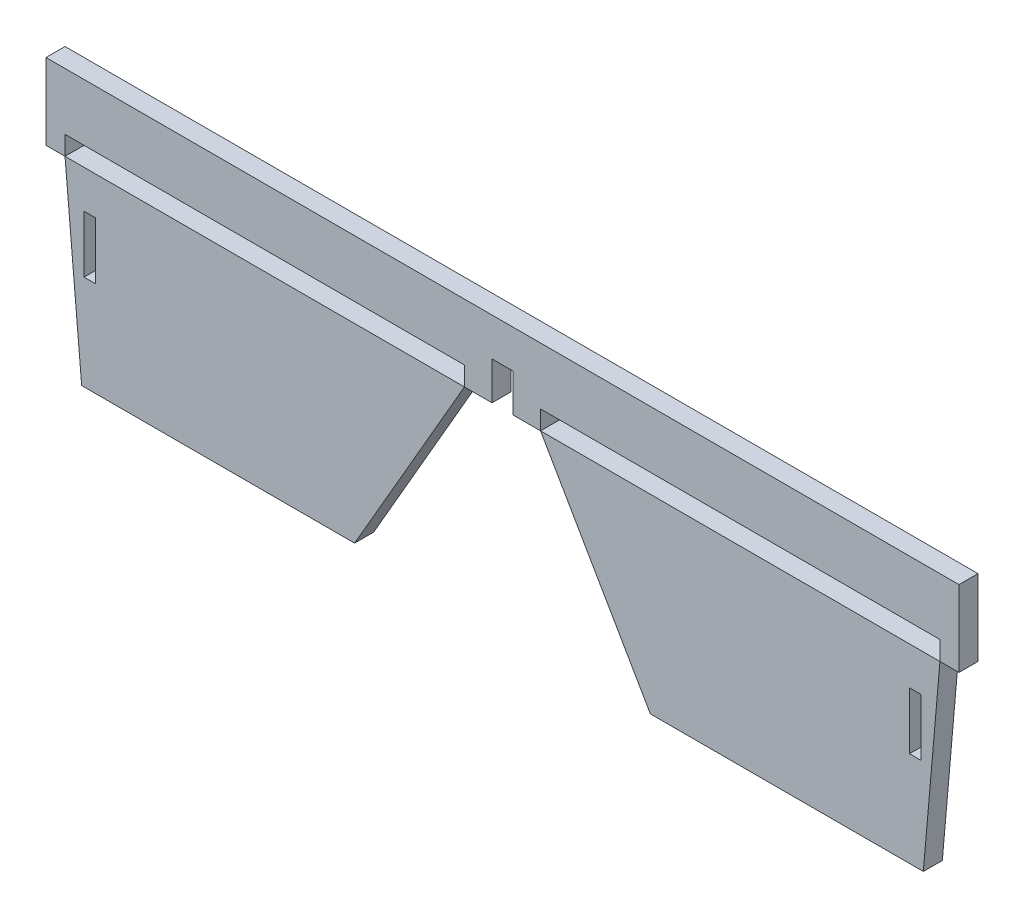
ISO-10303-21;
HEADER;
FILE_DESCRIPTION(('STEP AP214'),'2;1');
FILE_NAME('part.step','',(''),(''),'','','');
FILE_SCHEMA(('AUTOMOTIVE_DESIGN { 1 0 10303 214 1 1 1 1 }'));
ENDSEC;
DATA;
#1=APPLICATION_CONTEXT('core data for automotive mechanical design processes');
#2=APPLICATION_PROTOCOL_DEFINITION('international standard','automotive_design',2000,#1);
#3=PRODUCT_CONTEXT('',#1,'mechanical');
#4=PRODUCT('Part','Part','',(#3));
#5=PRODUCT_RELATED_PRODUCT_CATEGORY('part','',(#4));
#6=PRODUCT_DEFINITION_FORMATION('','',#4);
#7=PRODUCT_DEFINITION_CONTEXT('part definition',#1,'design');
#8=PRODUCT_DEFINITION('design','',#6,#7);
#9=PRODUCT_DEFINITION_SHAPE('','',#8);
#10=(LENGTH_UNIT() NAMED_UNIT(*) SI_UNIT(.MILLI.,.METRE.));
#11=(NAMED_UNIT(*) PLANE_ANGLE_UNIT() SI_UNIT($,.RADIAN.));
#12=(NAMED_UNIT(*) SI_UNIT($,.STERADIAN.) SOLID_ANGLE_UNIT());
#13=UNCERTAINTY_MEASURE_WITH_UNIT(LENGTH_MEASURE(1.E-05),#10,'distance_accuracy_value','');
#14=(GEOMETRIC_REPRESENTATION_CONTEXT(3) GLOBAL_UNCERTAINTY_ASSIGNED_CONTEXT((#13)) GLOBAL_UNIT_ASSIGNED_CONTEXT((#10,
#11,#12)) REPRESENTATION_CONTEXT('',''));
#15=CARTESIAN_POINT('',(0.,0.,0.));
#16=DIRECTION('',(0.,0.,1.));
#17=DIRECTION('',(1.,0.,0.));
#18=AXIS2_PLACEMENT_3D('',#15,#16,#17);
#19=CARTESIAN_POINT('',(0.,-20.,2.5));
#20=DIRECTION('',(0.,1.,0.));
#21=DIRECTION('',(0.,0.,1.));
#22=AXIS2_PLACEMENT_3D('',#19,#20,#21);
#23=PLANE('',#22);
#24=DIRECTION('',(-1.,0.,0.));
#25=VECTOR('',#24,1.);
#26=CARTESIAN_POINT('',(0.,-20.,-2.5));
#27=LINE('',#26,#25);
#28=CARTESIAN_POINT('',(110.,-20.,-2.5));
#29=VERTEX_POINT('',#28);
#30=CARTESIAN_POINT('',(107.,-20.,-2.5));
#31=VERTEX_POINT('',#30);
#32=EDGE_CURVE('E154',#29,#31,#27,.T.);
#33=ORIENTED_EDGE('',*,*,#32,.F.);
#34=DIRECTION('',(0.,0.,-1.));
#35=VECTOR('',#34,1.);
#36=CARTESIAN_POINT('',(110.,-20.,2.5));
#37=LINE('',#36,#35);
#38=CARTESIAN_POINT('',(110.,-20.,2.5));
#39=VERTEX_POINT('',#38);
#40=EDGE_CURVE('E161',#39,#29,#37,.T.);
#41=ORIENTED_EDGE('',*,*,#40,.F.);
#42=DIRECTION('',(-1.,0.,0.));
#43=VECTOR('',#42,1.);
#44=CARTESIAN_POINT('',(0.,-20.,2.5));
#45=LINE('',#44,#43);
#46=CARTESIAN_POINT('',(107.,-20.,2.5));
#47=VERTEX_POINT('',#46);
#48=EDGE_CURVE('E136',#39,#47,#45,.T.);
#49=ORIENTED_EDGE('',*,*,#48,.T.);
#50=DIRECTION('',(0.,0.,-1.));
#51=VECTOR('',#50,1.);
#52=CARTESIAN_POINT('',(107.,-20.,2.5));
#53=LINE('',#52,#51);
#54=EDGE_CURVE('E12',#47,#31,#53,.T.);
#55=ORIENTED_EDGE('',*,*,#54,.T.);
#56=EDGE_LOOP('',(#33,#41,#49,#55));
#57=FACE_BOUND('',#56,.T.);
#58=ADVANCED_FACE('F46',(#57),#23,.F.);
#59=CARTESIAN_POINT('',(107.,0.,2.5));
#60=DIRECTION('',(-1.,0.,0.));
#61=DIRECTION('',(0.,1.,0.));
#62=AXIS2_PLACEMENT_3D('',#59,#60,#61);
#63=PLANE('',#62);
#64=DIRECTION('',(0.,-1.,0.));
#65=VECTOR('',#64,1.);
#66=CARTESIAN_POINT('',(107.,0.,-2.5));
#67=LINE('',#66,#65);
#68=CARTESIAN_POINT('',(107.,-35.,-2.5));
#69=VERTEX_POINT('',#68);
#70=EDGE_CURVE('E156',#31,#69,#67,.T.);
#71=ORIENTED_EDGE('',*,*,#70,.F.);
#72=ORIENTED_EDGE('',*,*,#54,.F.);
#73=DIRECTION('',(0.,-1.,0.));
#74=VECTOR('',#73,1.);
#75=CARTESIAN_POINT('',(107.,0.,2.5));
#76=LINE('',#75,#74);
#77=CARTESIAN_POINT('',(107.,-35.,2.5));
#78=VERTEX_POINT('',#77);
#79=EDGE_CURVE('E123',#47,#78,#76,.T.);
#80=ORIENTED_EDGE('',*,*,#79,.T.);
#81=DIRECTION('',(0.,0.,-1.));
#82=VECTOR('',#81,1.);
#83=CARTESIAN_POINT('',(107.,-35.,2.5));
#84=LINE('',#83,#82);
#85=EDGE_CURVE('E56',#78,#69,#84,.T.);
#86=ORIENTED_EDGE('',*,*,#85,.T.);
#87=EDGE_LOOP('',(#71,#72,#80,#86));
#88=FACE_BOUND('',#87,.T.);
#89=ADVANCED_FACE('F134',(#88),#63,.F.);
#90=CARTESIAN_POINT('',(0.,-35.,2.5));
#91=DIRECTION('',(0.,1.,0.));
#92=DIRECTION('',(0.,0.,1.));
#93=AXIS2_PLACEMENT_3D('',#90,#91,#92);
#94=PLANE('',#93);
#95=DIRECTION('',(-1.,0.,0.));
#96=VECTOR('',#95,1.);
#97=CARTESIAN_POINT('',(0.,-35.,-2.5));
#98=LINE('',#97,#96);
#99=CARTESIAN_POINT('',(110.,-35.,-2.5));
#100=VERTEX_POINT('',#99);
#101=EDGE_CURVE('E129',#100,#69,#98,.T.);
#102=ORIENTED_EDGE('',*,*,#101,.T.);
#103=ORIENTED_EDGE('',*,*,#85,.F.);
#104=DIRECTION('',(-1.,0.,0.));
#105=VECTOR('',#104,1.);
#106=CARTESIAN_POINT('',(0.,-35.,2.5));
#107=LINE('',#106,#105);
#108=CARTESIAN_POINT('',(110.,-35.,2.5));
#109=VERTEX_POINT('',#108);
#110=EDGE_CURVE('E119',#109,#78,#107,.T.);
#111=ORIENTED_EDGE('',*,*,#110,.F.);
#112=DIRECTION('',(0.,0.,-1.));
#113=VECTOR('',#112,1.);
#114=CARTESIAN_POINT('',(110.,-35.,2.5));
#115=LINE('',#114,#113);
#116=EDGE_CURVE('E132',#109,#100,#115,.T.);
#117=ORIENTED_EDGE('',*,*,#116,.T.);
#118=EDGE_LOOP('',(#102,#103,#111,#117));
#119=FACE_BOUND('',#118,.T.);
#120=ADVANCED_FACE('F128',(#119),#94,.T.);
#121=CARTESIAN_POINT('',(114.994686686537,-10.0607314507871,2.5));
#122=DIRECTION('',(-0.996194698091746,0.0871557427476551,0.));
#123=DIRECTION('',(0.0871557427476551,0.996194698091746,0.));
#124=AXIS2_PLACEMENT_3D('',#121,#122,#123);
#125=PLANE('',#124);
#126=DIRECTION('',(-0.0871557427476551,-0.996194698091746,0.));
#127=VECTOR('',#126,1.);
#128=CARTESIAN_POINT('',(114.994686686537,-10.0607314507871,-2.5));
#129=LINE('',#128,#127);
#130=CARTESIAN_POINT('',(115.,-10.,-2.5));
#131=VERTEX_POINT('',#130);
#132=CARTESIAN_POINT('',(110.625566823704,-60.,-2.5));
#133=VERTEX_POINT('',#132);
#134=EDGE_CURVE('E144',#131,#133,#129,.T.);
#135=ORIENTED_EDGE('',*,*,#134,.F.);
#136=DIRECTION('',(0.,0.,-1.));
#137=VECTOR('',#136,1.);
#138=CARTESIAN_POINT('',(115.,-10.,2.5));
#139=LINE('',#138,#137);
#140=CARTESIAN_POINT('',(115.,-10.,2.5));
#141=VERTEX_POINT('',#140);
#142=EDGE_CURVE('E143',#141,#131,#139,.T.);
#143=ORIENTED_EDGE('',*,*,#142,.F.);
#144=DIRECTION('',(-0.0871557427476551,-0.996194698091746,0.));
#145=VECTOR('',#144,1.);
#146=CARTESIAN_POINT('',(114.994686686537,-10.0607314507871,2.5));
#147=LINE('',#146,#145);
#148=CARTESIAN_POINT('',(110.625566823704,-60.,2.5));
#149=VERTEX_POINT('',#148);
#150=EDGE_CURVE('E160',#141,#149,#147,.T.);
#151=ORIENTED_EDGE('',*,*,#150,.T.);
#152=DIRECTION('',(0.,0.,-1.));
#153=VECTOR('',#152,1.);
#154=CARTESIAN_POINT('',(110.625566823704,-60.,2.5));
#155=LINE('',#154,#153);
#156=EDGE_CURVE('E50',#149,#133,#155,.T.);
#157=ORIENTED_EDGE('',*,*,#156,.T.);
#158=EDGE_LOOP('',(#135,#143,#151,#157));
#159=FACE_BOUND('',#158,.T.);
#160=ADVANCED_FACE('F48',(#159),#125,.F.);
#161=CARTESIAN_POINT('',(0.,-60.,2.5));
#162=DIRECTION('',(0.,1.,0.));
#163=DIRECTION('',(0.,0.,1.));
#164=AXIS2_PLACEMENT_3D('',#161,#162,#163);
#165=PLANE('',#164);
#166=DIRECTION('',(-1.,0.,0.));
#167=VECTOR('',#166,1.);
#168=CARTESIAN_POINT('',(0.,-60.,-2.5));
#169=LINE('',#168,#167);
#170=CARTESIAN_POINT('',(38.8675134594816,-60.,-2.5));
#171=VERTEX_POINT('',#170);
#172=EDGE_CURVE('E147',#133,#171,#169,.T.);
#173=ORIENTED_EDGE('',*,*,#172,.F.);
#174=ORIENTED_EDGE('',*,*,#156,.F.);
#175=DIRECTION('',(-1.,0.,0.));
#176=VECTOR('',#175,1.);
#177=CARTESIAN_POINT('',(0.,-60.,2.5));
#178=LINE('',#177,#176);
#179=CARTESIAN_POINT('',(38.8675134594816,-60.,2.5));
#180=VERTEX_POINT('',#179);
#181=EDGE_CURVE('E104',#149,#180,#178,.T.);
#182=ORIENTED_EDGE('',*,*,#181,.T.);
#183=DIRECTION('',(0.,0.,-1.));
#184=VECTOR('',#183,1.);
#185=CARTESIAN_POINT('',(38.8675134594816,-60.,2.5));
#186=LINE('',#185,#184);
#187=EDGE_CURVE('E168',#180,#171,#186,.T.);
#188=ORIENTED_EDGE('',*,*,#187,.T.);
#189=EDGE_LOOP('',(#173,#174,#182,#188));
#190=FACE_BOUND('',#189,.T.);
#191=ADVANCED_FACE('F190',(#190),#165,.F.);
#192=CARTESIAN_POINT('',(3.16987298107774,1.83012701892218,2.5));
#193=DIRECTION('',(-0.866025403784436,-0.500000000000004,0.));
#194=DIRECTION('',(-0.500000000000004,0.866025403784436,0.));
#195=AXIS2_PLACEMENT_3D('',#192,#193,#194);
#196=PLANE('',#195);
#197=DIRECTION('',(0.500000000000004,-0.866025403784436,0.));
#198=VECTOR('',#197,1.);
#199=CARTESIAN_POINT('',(3.16987298107774,1.83012701892218,-2.5));
#200=LINE('',#199,#198);
#201=CARTESIAN_POINT('',(10.,-10.,-2.5));
#202=VERTEX_POINT('',#201);
#203=EDGE_CURVE('E150',#202,#171,#200,.T.);
#204=ORIENTED_EDGE('',*,*,#203,.T.);
#205=ORIENTED_EDGE('',*,*,#187,.F.);
#206=DIRECTION('',(0.500000000000004,-0.866025403784436,0.));
#207=VECTOR('',#206,1.);
#208=CARTESIAN_POINT('',(3.16987298107774,1.83012701892218,2.5));
#209=LINE('',#208,#207);
#210=CARTESIAN_POINT('',(10.,-10.,2.5));
#211=VERTEX_POINT('',#210);
#212=EDGE_CURVE('E184',#211,#180,#209,.T.);
#213=ORIENTED_EDGE('',*,*,#212,.F.);
#214=DIRECTION('',(0.,0.,-1.));
#215=VECTOR('',#214,1.);
#216=CARTESIAN_POINT('',(10.,-10.,2.5));
#217=LINE('',#216,#215);
#218=EDGE_CURVE('E166',#211,#202,#217,.T.);
#219=ORIENTED_EDGE('',*,*,#218,.T.);
#220=EDGE_LOOP('',(#204,#205,#213,#219));
#221=FACE_BOUND('',#220,.T.);
#222=ADVANCED_FACE('F189',(#221),#196,.T.);
#223=CARTESIAN_POINT('',(0.,-10.,2.5));
#224=DIRECTION('',(0.,1.,0.));
#225=DIRECTION('',(0.,0.,1.));
#226=AXIS2_PLACEMENT_3D('',#223,#224,#225);
#227=PLANE('',#226);
#228=DIRECTION('',(-1.,0.,0.));
#229=VECTOR('',#228,1.);
#230=CARTESIAN_POINT('',(0.,-10.,-2.5));
#231=LINE('',#230,#229);
#232=EDGE_CURVE('E152',#131,#202,#231,.T.);
#233=ORIENTED_EDGE('',*,*,#232,.T.);
#234=ORIENTED_EDGE('',*,*,#218,.F.);
#235=DIRECTION('',(-1.,0.,0.));
#236=VECTOR('',#235,1.);
#237=CARTESIAN_POINT('',(0.,-10.,2.5));
#238=LINE('',#237,#236);
#239=EDGE_CURVE('E138',#141,#211,#238,.T.);
#240=ORIENTED_EDGE('',*,*,#239,.F.);
#241=ORIENTED_EDGE('',*,*,#142,.T.);
#242=EDGE_LOOP('',(#233,#234,#240,#241));
#243=FACE_BOUND('',#242,.T.);
#244=ADVANCED_FACE('F182',(#243),#227,.T.);
#245=CARTESIAN_POINT('',(110.,0.,2.5));
#246=DIRECTION('',(-1.,0.,0.));
#247=DIRECTION('',(0.,0.,-1.));
#248=AXIS2_PLACEMENT_3D('',#245,#246,#247);
#249=PLANE('',#248);
#250=DIRECTION('',(0.,-1.,0.));
#251=VECTOR('',#250,1.);
#252=CARTESIAN_POINT('',(110.,0.,-2.5));
#253=LINE('',#252,#251);
#254=EDGE_CURVE('E91',#29,#100,#253,.T.);
#255=ORIENTED_EDGE('',*,*,#254,.T.);
#256=ORIENTED_EDGE('',*,*,#116,.F.);
#257=DIRECTION('',(0.,-1.,0.));
#258=VECTOR('',#257,1.);
#259=CARTESIAN_POINT('',(110.,0.,2.5));
#260=LINE('',#259,#258);
#261=EDGE_CURVE('E65',#39,#109,#260,.T.);
#262=ORIENTED_EDGE('',*,*,#261,.F.);
#263=ORIENTED_EDGE('',*,*,#40,.T.);
#264=EDGE_LOOP('',(#255,#256,#262,#263));
#265=FACE_BOUND('',#264,.T.);
#266=ADVANCED_FACE('F208',(#265),#249,.T.);
#267=CARTESIAN_POINT('',(0.,0.,2.5));
#268=DIRECTION('',(0.,0.,1.));
#269=DIRECTION('',(-1.,0.,0.));
#270=AXIS2_PLACEMENT_3D('',#267,#268,#269);
#271=PLANE('',#270);
#272=ORIENTED_EDGE('',*,*,#150,.F.);
#273=ORIENTED_EDGE('',*,*,#239,.T.);
#274=ORIENTED_EDGE('',*,*,#212,.T.);
#275=ORIENTED_EDGE('',*,*,#181,.F.);
#276=EDGE_LOOP('',(#272,#273,#274,#275));
#277=FACE_BOUND('',#276,.T.);
#278=ORIENTED_EDGE('',*,*,#48,.F.);
#279=ORIENTED_EDGE('',*,*,#261,.T.);
#280=ORIENTED_EDGE('',*,*,#110,.T.);
#281=ORIENTED_EDGE('',*,*,#79,.F.);
#282=EDGE_LOOP('',(#278,#279,#280,#281));
#283=FACE_BOUND('',#282,.T.);
#284=ADVANCED_FACE('F121',(#277,#283),#271,.T.);
#285=CARTESIAN_POINT('',(0.,0.,-2.5));
#286=DIRECTION('',(0.,0.,1.));
#287=DIRECTION('',(-1.,0.,0.));
#288=AXIS2_PLACEMENT_3D('',#285,#286,#287);
#289=PLANE('',#288);
#290=ORIENTED_EDGE('',*,*,#134,.T.);
#291=ORIENTED_EDGE('',*,*,#172,.T.);
#292=ORIENTED_EDGE('',*,*,#203,.F.);
#293=ORIENTED_EDGE('',*,*,#232,.F.);
#294=EDGE_LOOP('',(#290,#291,#292,#293));
#295=FACE_BOUND('',#294,.T.);
#296=ORIENTED_EDGE('',*,*,#32,.T.);
#297=ORIENTED_EDGE('',*,*,#70,.T.);
#298=ORIENTED_EDGE('',*,*,#101,.F.);
#299=ORIENTED_EDGE('',*,*,#254,.F.);
#300=EDGE_LOOP('',(#296,#297,#298,#299));
#301=FACE_BOUND('',#300,.T.);
#302=ADVANCED_FACE('F178',(#295,#301),#289,.F.);
#303=CLOSED_SHELL('',(#58,#89,#120,#160,#191,#222,#244,#266,#284,#302));
#304=MANIFOLD_SOLID_BREP('B2',#303);
#305=CARTESIAN_POINT('',(-10.,0.,2.5));
#306=DIRECTION('',(-1.,0.,0.));
#307=DIRECTION('',(0.,-1.,0.));
#308=AXIS2_PLACEMENT_3D('',#305,#306,#307);
#309=PLANE('',#308);
#310=DIRECTION('',(0.,1.,0.));
#311=VECTOR('',#310,1.);
#312=CARTESIAN_POINT('',(-10.,0.,-2.5));
#313=LINE('',#312,#311);
#314=CARTESIAN_POINT('',(-10.,-10.,-2.5));
#315=VERTEX_POINT('',#314);
#316=CARTESIAN_POINT('',(-10.,-5.,-2.5));
#317=VERTEX_POINT('',#316);
#318=EDGE_CURVE('E391',#315,#317,#313,.T.);
#319=ORIENTED_EDGE('',*,*,#318,.F.);
#320=DIRECTION('',(0.,0.,-1.));
#321=VECTOR('',#320,1.);
#322=CARTESIAN_POINT('',(-10.,-10.,2.5));
#323=LINE('',#322,#321);
#324=CARTESIAN_POINT('',(-10.,-10.,2.5));
#325=VERTEX_POINT('',#324);
#326=EDGE_CURVE('E44',#325,#315,#323,.T.);
#327=ORIENTED_EDGE('',*,*,#326,.F.);
#328=DIRECTION('',(0.,1.,0.));
#329=VECTOR('',#328,1.);
#330=CARTESIAN_POINT('',(-10.,0.,2.5));
#331=LINE('',#330,#329);
#332=CARTESIAN_POINT('',(-10.,-5.,2.5));
#333=VERTEX_POINT('',#332);
#334=EDGE_CURVE('E412',#325,#333,#331,.T.);
#335=ORIENTED_EDGE('',*,*,#334,.T.);
#336=DIRECTION('',(0.,0.,-1.));
#337=VECTOR('',#336,1.);
#338=CARTESIAN_POINT('',(-10.,-5.,2.5));
#339=LINE('',#338,#337);
#340=EDGE_CURVE('E343',#333,#317,#339,.T.);
#341=ORIENTED_EDGE('',*,*,#340,.T.);
#342=EDGE_LOOP('',(#319,#327,#335,#341));
#343=FACE_BOUND('',#342,.T.);
#344=ADVANCED_FACE('F291',(#343),#309,.T.);
#345=CARTESIAN_POINT('',(0.,-10.,2.5));
#346=DIRECTION('',(0.,1.,0.));
#347=DIRECTION('',(0.,0.,1.));
#348=AXIS2_PLACEMENT_3D('',#345,#346,#347);
#349=PLANE('',#348);
#350=DIRECTION('',(1.,0.,0.));
#351=VECTOR('',#350,1.);
#352=CARTESIAN_POINT('',(0.,-10.,-2.5));
#353=LINE('',#352,#351);
#354=CARTESIAN_POINT('',(-2.75,-10.,-2.5));
#355=VERTEX_POINT('',#354);
#356=EDGE_CURVE('E394',#315,#355,#353,.T.);
#357=ORIENTED_EDGE('',*,*,#356,.T.);
#358=DIRECTION('',(0.,0.,-1.));
#359=VECTOR('',#358,1.);
#360=CARTESIAN_POINT('',(-2.75,-10.,2.5));
#361=LINE('',#360,#359);
#362=CARTESIAN_POINT('',(-2.75,-10.,2.5));
#363=VERTEX_POINT('',#362);
#364=EDGE_CURVE('E299',#363,#355,#361,.T.);
#365=ORIENTED_EDGE('',*,*,#364,.F.);
#366=DIRECTION('',(1.,0.,0.));
#367=VECTOR('',#366,1.);
#368=CARTESIAN_POINT('',(0.,-10.,2.5));
#369=LINE('',#368,#367);
#370=EDGE_CURVE('E377',#325,#363,#369,.T.);
#371=ORIENTED_EDGE('',*,*,#370,.F.);
#372=ORIENTED_EDGE('',*,*,#326,.T.);
#373=EDGE_LOOP('',(#357,#365,#371,#372));
#374=FACE_BOUND('',#373,.T.);
#375=ADVANCED_FACE('F428',(#374),#349,.F.);
#376=CARTESIAN_POINT('',(-2.75,0.,2.5));
#377=DIRECTION('',(1.,0.,0.));
#378=DIRECTION('',(0.,1.,0.));
#379=AXIS2_PLACEMENT_3D('',#376,#377,#378);
#380=PLANE('',#379);
#381=DIRECTION('',(0.,-1.,0.));
#382=VECTOR('',#381,1.);
#383=CARTESIAN_POINT('',(-2.75,0.,-2.5));
#384=LINE('',#383,#382);
#385=CARTESIAN_POINT('',(-2.75,0.,-2.5));
#386=VERTEX_POINT('',#385);
#387=EDGE_CURVE('E398',#386,#355,#384,.T.);
#388=ORIENTED_EDGE('',*,*,#387,.F.);
#389=DIRECTION('',(0.,0.,-1.));
#390=VECTOR('',#389,1.);
#391=CARTESIAN_POINT('',(-2.75,0.,2.5));
#392=LINE('',#391,#390);
#393=CARTESIAN_POINT('',(-2.75,0.,2.5));
#394=VERTEX_POINT('',#393);
#395=EDGE_CURVE('E418',#394,#386,#392,.T.);
#396=ORIENTED_EDGE('',*,*,#395,.F.);
#397=DIRECTION('',(0.,-1.,0.));
#398=VECTOR('',#397,1.);
#399=CARTESIAN_POINT('',(-2.75,0.,2.5));
#400=LINE('',#399,#398);
#401=EDGE_CURVE('E425',#394,#363,#400,.T.);
#402=ORIENTED_EDGE('',*,*,#401,.T.);
#403=ORIENTED_EDGE('',*,*,#364,.T.);
#404=EDGE_LOOP('',(#388,#396,#402,#403));
#405=FACE_BOUND('',#404,.T.);
#406=ADVANCED_FACE('F423',(#405),#380,.T.);
#407=CARTESIAN_POINT('',(0.,0.,2.5));
#408=DIRECTION('',(0.,1.,0.));
#409=DIRECTION('',(0.,0.,1.));
#410=AXIS2_PLACEMENT_3D('',#407,#408,#409);
#411=PLANE('',#410);
#412=DIRECTION('',(1.,0.,0.));
#413=VECTOR('',#412,1.);
#414=CARTESIAN_POINT('',(0.,0.,-2.5));
#415=LINE('',#414,#413);
#416=CARTESIAN_POINT('',(2.75,0.,-2.5));
#417=VERTEX_POINT('',#416);
#418=EDGE_CURVE('E401',#386,#417,#415,.T.);
#419=ORIENTED_EDGE('',*,*,#418,.T.);
#420=DIRECTION('',(0.,0.,-1.));
#421=VECTOR('',#420,1.);
#422=CARTESIAN_POINT('',(2.75,0.,2.5));
#423=LINE('',#422,#421);
#424=CARTESIAN_POINT('',(2.75,0.,2.5));
#425=VERTEX_POINT('',#424);
#426=EDGE_CURVE('E443',#425,#417,#423,.T.);
#427=ORIENTED_EDGE('',*,*,#426,.F.);
#428=DIRECTION('',(1.,0.,0.));
#429=VECTOR('',#428,1.);
#430=CARTESIAN_POINT('',(0.,0.,2.5));
#431=LINE('',#430,#429);
#432=EDGE_CURVE('E467',#394,#425,#431,.T.);
#433=ORIENTED_EDGE('',*,*,#432,.F.);
#434=ORIENTED_EDGE('',*,*,#395,.T.);
#435=EDGE_LOOP('',(#419,#427,#433,#434));
#436=FACE_BOUND('',#435,.T.);
#437=ADVANCED_FACE('F440',(#436),#411,.F.);
#438=CARTESIAN_POINT('',(0.,10.,2.5));
#439=DIRECTION('',(0.,1.,0.));
#440=DIRECTION('',(0.,0.,1.));
#441=AXIS2_PLACEMENT_3D('',#438,#439,#440);
#442=PLANE('',#441);
#443=DIRECTION('',(1.,0.,0.));
#444=VECTOR('',#443,1.);
#445=CARTESIAN_POINT('',(0.,10.,-2.5));
#446=LINE('',#445,#444);
#447=CARTESIAN_POINT('',(-120.,10.,-2.5));
#448=VERTEX_POINT('',#447);
#449=CARTESIAN_POINT('',(120.,10.,-2.5));
#450=VERTEX_POINT('',#449);
#451=EDGE_CURVE('E404',#448,#450,#446,.T.);
#452=ORIENTED_EDGE('',*,*,#451,.F.);
#453=DIRECTION('',(0.,0.,-1.));
#454=VECTOR('',#453,1.);
#455=CARTESIAN_POINT('',(-120.,10.,2.5));
#456=LINE('',#455,#454);
#457=CARTESIAN_POINT('',(-120.,10.,2.5));
#458=VERTEX_POINT('',#457);
#459=EDGE_CURVE('E416',#458,#448,#456,.T.);
#460=ORIENTED_EDGE('',*,*,#459,.F.);
#461=DIRECTION('',(1.,0.,0.));
#462=VECTOR('',#461,1.);
#463=CARTESIAN_POINT('',(0.,10.,2.5));
#464=LINE('',#463,#462);
#465=CARTESIAN_POINT('',(120.,10.,2.5));
#466=VERTEX_POINT('',#465);
#467=EDGE_CURVE('E469',#458,#466,#464,.T.);
#468=ORIENTED_EDGE('',*,*,#467,.T.);
#469=DIRECTION('',(0.,0.,-1.));
#470=VECTOR('',#469,1.);
#471=CARTESIAN_POINT('',(120.,10.,2.5));
#472=LINE('',#471,#470);
#473=EDGE_CURVE('E455',#466,#450,#472,.T.);
#474=ORIENTED_EDGE('',*,*,#473,.T.);
#475=EDGE_LOOP('',(#452,#460,#468,#474));
#476=FACE_BOUND('',#475,.T.);
#477=ADVANCED_FACE('F475',(#476),#442,.T.);
#478=CARTESIAN_POINT('',(-120.,0.,2.5));
#479=DIRECTION('',(1.,0.,0.));
#480=DIRECTION('',(0.,0.,-1.));
#481=AXIS2_PLACEMENT_3D('',#478,#479,#480);
#482=PLANE('',#481);
#483=DIRECTION('',(0.,-1.,0.));
#484=VECTOR('',#483,1.);
#485=CARTESIAN_POINT('',(-120.,0.,-2.5));
#486=LINE('',#485,#484);
#487=CARTESIAN_POINT('',(-120.,-10.,-2.5));
#488=VERTEX_POINT('',#487);
#489=EDGE_CURVE('E407',#448,#488,#486,.T.);
#490=ORIENTED_EDGE('',*,*,#489,.T.);
#491=DIRECTION('',(0.,0.,-1.));
#492=VECTOR('',#491,1.);
#493=CARTESIAN_POINT('',(-120.,-10.,2.5));
#494=LINE('',#493,#492);
#495=CARTESIAN_POINT('',(-120.,-10.,2.5));
#496=VERTEX_POINT('',#495);
#497=EDGE_CURVE('E382',#496,#488,#494,.T.);
#498=ORIENTED_EDGE('',*,*,#497,.F.);
#499=DIRECTION('',(0.,-1.,0.));
#500=VECTOR('',#499,1.);
#501=CARTESIAN_POINT('',(-120.,0.,2.5));
#502=LINE('',#501,#500);
#503=EDGE_CURVE('E372',#458,#496,#502,.T.);
#504=ORIENTED_EDGE('',*,*,#503,.F.);
#505=ORIENTED_EDGE('',*,*,#459,.T.);
#506=EDGE_LOOP('',(#490,#498,#504,#505));
#507=FACE_BOUND('',#506,.T.);
#508=ADVANCED_FACE('F583',(#507),#482,.F.);
#509=CARTESIAN_POINT('',(-115.,-10.,-2.5));
#510=VERTEX_POINT('',#509);
#511=EDGE_CURVE('E381',#488,#510,#353,.T.);
#512=ORIENTED_EDGE('',*,*,#511,.T.);
#513=DIRECTION('',(0.,0.,-1.));
#514=VECTOR('',#513,1.);
#515=CARTESIAN_POINT('',(-115.,-10.,2.5));
#516=LINE('',#515,#514);
#517=CARTESIAN_POINT('',(-115.,-10.,2.5));
#518=VERTEX_POINT('',#517);
#519=EDGE_CURVE('E378',#518,#510,#516,.T.);
#520=ORIENTED_EDGE('',*,*,#519,.F.);
#521=EDGE_CURVE('E365',#496,#518,#369,.T.);
#522=ORIENTED_EDGE('',*,*,#521,.F.);
#523=ORIENTED_EDGE('',*,*,#497,.T.);
#524=EDGE_LOOP('',(#512,#520,#522,#523));
#525=FACE_BOUND('',#524,.T.);
#526=ADVANCED_FACE('F379',(#525),#349,.F.);
#527=CARTESIAN_POINT('',(-115.,0.,2.5));
#528=DIRECTION('',(-1.,0.,0.));
#529=DIRECTION('',(0.,0.,1.));
#530=AXIS2_PLACEMENT_3D('',#527,#528,#529);
#531=PLANE('',#530);
#532=DIRECTION('',(0.,1.,0.));
#533=VECTOR('',#532,1.);
#534=CARTESIAN_POINT('',(-115.,0.,-2.5));
#535=LINE('',#534,#533);
#536=CARTESIAN_POINT('',(-115.,-5.,-2.5));
#537=VERTEX_POINT('',#536);
#538=EDGE_CURVE('E336',#510,#537,#535,.T.);
#539=ORIENTED_EDGE('',*,*,#538,.T.);
#540=DIRECTION('',(0.,0.,-1.));
#541=VECTOR('',#540,1.);
#542=CARTESIAN_POINT('',(-115.,-5.,2.5));
#543=LINE('',#542,#541);
#544=CARTESIAN_POINT('',(-115.,-5.,2.5));
#545=VERTEX_POINT('',#544);
#546=EDGE_CURVE('E383',#545,#537,#543,.T.);
#547=ORIENTED_EDGE('',*,*,#546,.F.);
#548=DIRECTION('',(0.,1.,0.));
#549=VECTOR('',#548,1.);
#550=CARTESIAN_POINT('',(-115.,0.,2.5));
#551=LINE('',#550,#549);
#552=EDGE_CURVE('E369',#518,#545,#551,.T.);
#553=ORIENTED_EDGE('',*,*,#552,.F.);
#554=ORIENTED_EDGE('',*,*,#519,.T.);
#555=EDGE_LOOP('',(#539,#547,#553,#554));
#556=FACE_BOUND('',#555,.T.);
#557=ADVANCED_FACE('F385',(#556),#531,.F.);
#558=CARTESIAN_POINT('',(0.,-5.,2.5));
#559=DIRECTION('',(0.,1.,0.));
#560=DIRECTION('',(0.,0.,1.));
#561=AXIS2_PLACEMENT_3D('',#558,#559,#560);
#562=PLANE('',#561);
#563=DIRECTION('',(1.,0.,0.));
#564=VECTOR('',#563,1.);
#565=CARTESIAN_POINT('',(0.,-5.,-2.5));
#566=LINE('',#565,#564);
#567=EDGE_CURVE('E410',#537,#317,#566,.T.);
#568=ORIENTED_EDGE('',*,*,#567,.T.);
#569=ORIENTED_EDGE('',*,*,#340,.F.);
#570=DIRECTION('',(1.,0.,0.));
#571=VECTOR('',#570,1.);
#572=CARTESIAN_POINT('',(0.,-5.,2.5));
#573=LINE('',#572,#571);
#574=EDGE_CURVE('E307',#545,#333,#573,.T.);
#575=ORIENTED_EDGE('',*,*,#574,.F.);
#576=ORIENTED_EDGE('',*,*,#546,.T.);
#577=EDGE_LOOP('',(#568,#569,#575,#576));
#578=FACE_BOUND('',#577,.T.);
#579=ADVANCED_FACE('F588',(#578),#562,.F.);
#580=CARTESIAN_POINT('',(0.,0.,2.5));
#581=DIRECTION('',(0.,0.,1.));
#582=DIRECTION('',(1.,0.,0.));
#583=AXIS2_PLACEMENT_3D('',#580,#581,#582);
#584=PLANE('',#583);
#585=ORIENTED_EDGE('',*,*,#334,.F.);
#586=ORIENTED_EDGE('',*,*,#370,.T.);
#587=ORIENTED_EDGE('',*,*,#401,.F.);
#588=ORIENTED_EDGE('',*,*,#432,.T.);
#589=DIRECTION('',(0.,-1.,0.));
#590=VECTOR('',#589,1.);
#591=CARTESIAN_POINT('',(2.75,0.,2.5));
#592=LINE('',#591,#590);
#593=CARTESIAN_POINT('',(2.75,-10.,2.5));
#594=VERTEX_POINT('',#593);
#595=EDGE_CURVE('E453',#425,#594,#592,.T.);
#596=ORIENTED_EDGE('',*,*,#595,.T.);
#597=DIRECTION('',(-1.,0.,0.));
#598=VECTOR('',#597,1.);
#599=CARTESIAN_POINT('',(0.,-10.,2.5));
#600=LINE('',#599,#598);
#601=CARTESIAN_POINT('',(10.,-10.,2.5));
#602=VERTEX_POINT('',#601);
#603=EDGE_CURVE('E565',#602,#594,#600,.T.);
#604=ORIENTED_EDGE('',*,*,#603,.F.);
#605=DIRECTION('',(0.,1.,0.));
#606=VECTOR('',#605,1.);
#607=CARTESIAN_POINT('',(10.,0.,2.5));
#608=LINE('',#607,#606);
#609=CARTESIAN_POINT('',(10.,-5.,2.5));
#610=VERTEX_POINT('',#609);
#611=EDGE_CURVE('E508',#602,#610,#608,.T.);
#612=ORIENTED_EDGE('',*,*,#611,.T.);
#613=DIRECTION('',(-1.,0.,0.));
#614=VECTOR('',#613,1.);
#615=CARTESIAN_POINT('',(0.,-5.,2.5));
#616=LINE('',#615,#614);
#617=CARTESIAN_POINT('',(115.,-5.,2.5));
#618=VERTEX_POINT('',#617);
#619=EDGE_CURVE('E513',#618,#610,#616,.T.);
#620=ORIENTED_EDGE('',*,*,#619,.F.);
#621=DIRECTION('',(0.,1.,0.));
#622=VECTOR('',#621,1.);
#623=CARTESIAN_POINT('',(115.,0.,2.5));
#624=LINE('',#623,#622);
#625=CARTESIAN_POINT('',(115.,-10.,2.5));
#626=VERTEX_POINT('',#625);
#627=EDGE_CURVE('E534',#626,#618,#624,.T.);
#628=ORIENTED_EDGE('',*,*,#627,.F.);
#629=CARTESIAN_POINT('',(120.,-10.,2.5));
#630=VERTEX_POINT('',#629);
#631=EDGE_CURVE('E484',#630,#626,#600,.T.);
#632=ORIENTED_EDGE('',*,*,#631,.F.);
#633=DIRECTION('',(0.,-1.,0.));
#634=VECTOR('',#633,1.);
#635=CARTESIAN_POINT('',(120.,0.,2.5));
#636=LINE('',#635,#634);
#637=EDGE_CURVE('E481',#466,#630,#636,.T.);
#638=ORIENTED_EDGE('',*,*,#637,.F.);
#639=ORIENTED_EDGE('',*,*,#467,.F.);
#640=ORIENTED_EDGE('',*,*,#503,.T.);
#641=ORIENTED_EDGE('',*,*,#521,.T.);
#642=ORIENTED_EDGE('',*,*,#552,.T.);
#643=ORIENTED_EDGE('',*,*,#574,.T.);
#644=EDGE_LOOP('',(#585,#586,#587,#588,#596,#604,#612,#620,#628,#632,#638,#639,#640,#641,#642,#643));
#645=FACE_BOUND('',#644,.T.);
#646=ADVANCED_FACE('F367',(#645),#584,.T.);
#647=CARTESIAN_POINT('',(0.,0.,-2.5));
#648=DIRECTION('',(0.,0.,1.));
#649=DIRECTION('',(1.,0.,0.));
#650=AXIS2_PLACEMENT_3D('',#647,#648,#649);
#651=PLANE('',#650);
#652=ORIENTED_EDGE('',*,*,#318,.T.);
#653=ORIENTED_EDGE('',*,*,#567,.F.);
#654=ORIENTED_EDGE('',*,*,#538,.F.);
#655=ORIENTED_EDGE('',*,*,#511,.F.);
#656=ORIENTED_EDGE('',*,*,#489,.F.);
#657=ORIENTED_EDGE('',*,*,#451,.T.);
#658=DIRECTION('',(0.,-1.,0.));
#659=VECTOR('',#658,1.);
#660=CARTESIAN_POINT('',(120.,0.,-2.5));
#661=LINE('',#660,#659);
#662=CARTESIAN_POINT('',(120.,-10.,-2.5));
#663=VERTEX_POINT('',#662);
#664=EDGE_CURVE('E492',#450,#663,#661,.T.);
#665=ORIENTED_EDGE('',*,*,#664,.T.);
#666=DIRECTION('',(-1.,0.,0.));
#667=VECTOR('',#666,1.);
#668=CARTESIAN_POINT('',(0.,-10.,-2.5));
#669=LINE('',#668,#667);
#670=CARTESIAN_POINT('',(115.,-10.,-2.5));
#671=VERTEX_POINT('',#670);
#672=EDGE_CURVE('E496',#663,#671,#669,.T.);
#673=ORIENTED_EDGE('',*,*,#672,.T.);
#674=DIRECTION('',(0.,1.,0.));
#675=VECTOR('',#674,1.);
#676=CARTESIAN_POINT('',(115.,0.,-2.5));
#677=LINE('',#676,#675);
#678=CARTESIAN_POINT('',(115.,-5.,-2.5));
#679=VERTEX_POINT('',#678);
#680=EDGE_CURVE('E498',#671,#679,#677,.T.);
#681=ORIENTED_EDGE('',*,*,#680,.T.);
#682=DIRECTION('',(-1.,0.,0.));
#683=VECTOR('',#682,1.);
#684=CARTESIAN_POINT('',(0.,-5.,-2.5));
#685=LINE('',#684,#683);
#686=CARTESIAN_POINT('',(10.,-5.,-2.5));
#687=VERTEX_POINT('',#686);
#688=EDGE_CURVE('E505',#679,#687,#685,.T.);
#689=ORIENTED_EDGE('',*,*,#688,.T.);
#690=DIRECTION('',(0.,1.,0.));
#691=VECTOR('',#690,1.);
#692=CARTESIAN_POINT('',(10.,0.,-2.5));
#693=LINE('',#692,#691);
#694=CARTESIAN_POINT('',(10.,-10.,-2.5));
#695=VERTEX_POINT('',#694);
#696=EDGE_CURVE('E555',#695,#687,#693,.T.);
#697=ORIENTED_EDGE('',*,*,#696,.F.);
#698=CARTESIAN_POINT('',(2.75,-10.,-2.5));
#699=VERTEX_POINT('',#698);
#700=EDGE_CURVE('E500',#695,#699,#669,.T.);
#701=ORIENTED_EDGE('',*,*,#700,.T.);
#702=DIRECTION('',(0.,-1.,0.));
#703=VECTOR('',#702,1.);
#704=CARTESIAN_POINT('',(2.75,0.,-2.5));
#705=LINE('',#704,#703);
#706=EDGE_CURVE('E436',#417,#699,#705,.T.);
#707=ORIENTED_EDGE('',*,*,#706,.F.);
#708=ORIENTED_EDGE('',*,*,#418,.F.);
#709=ORIENTED_EDGE('',*,*,#387,.T.);
#710=ORIENTED_EDGE('',*,*,#356,.F.);
#711=EDGE_LOOP('',(#652,#653,#654,#655,#656,#657,#665,#673,#681,#689,#697,#701,#707,#708,#709,#710));
#712=FACE_BOUND('',#711,.T.);
#713=ADVANCED_FACE('F431',(#712),#651,.F.);
#714=CARTESIAN_POINT('',(10.,0.,2.5));
#715=DIRECTION('',(1.,0.,0.));
#716=DIRECTION('',(0.,-1.,0.));
#717=AXIS2_PLACEMENT_3D('',#714,#715,#716);
#718=PLANE('',#717);
#719=ORIENTED_EDGE('',*,*,#696,.T.);
#720=DIRECTION('',(0.,0.,-1.));
#721=VECTOR('',#720,1.);
#722=CARTESIAN_POINT('',(10.,-5.,2.5));
#723=LINE('',#722,#721);
#724=EDGE_CURVE('E509',#610,#687,#723,.T.);
#725=ORIENTED_EDGE('',*,*,#724,.F.);
#726=ORIENTED_EDGE('',*,*,#611,.F.);
#727=DIRECTION('',(0.,0.,-1.));
#728=VECTOR('',#727,1.);
#729=CARTESIAN_POINT('',(10.,-10.,2.5));
#730=LINE('',#729,#728);
#731=EDGE_CURVE('E395',#602,#695,#730,.T.);
#732=ORIENTED_EDGE('',*,*,#731,.T.);
#733=EDGE_LOOP('',(#719,#725,#726,#732));
#734=FACE_BOUND('',#733,.T.);
#735=ADVANCED_FACE('F558',(#734),#718,.T.);
#736=CARTESIAN_POINT('',(0.,-10.,2.5));
#737=DIRECTION('',(0.,1.,0.));
#738=DIRECTION('',(0.,0.,1.));
#739=AXIS2_PLACEMENT_3D('',#736,#737,#738);
#740=PLANE('',#739);
#741=ORIENTED_EDGE('',*,*,#700,.F.);
#742=ORIENTED_EDGE('',*,*,#731,.F.);
#743=ORIENTED_EDGE('',*,*,#603,.T.);
#744=DIRECTION('',(0.,0.,-1.));
#745=VECTOR('',#744,1.);
#746=CARTESIAN_POINT('',(2.75,-10.,2.5));
#747=LINE('',#746,#745);
#748=EDGE_CURVE('E454',#594,#699,#747,.T.);
#749=ORIENTED_EDGE('',*,*,#748,.T.);
#750=EDGE_LOOP('',(#741,#742,#743,#749));
#751=FACE_BOUND('',#750,.T.);
#752=ADVANCED_FACE('F551',(#751),#740,.F.);
#753=CARTESIAN_POINT('',(2.75,0.,2.5));
#754=DIRECTION('',(-1.,0.,0.));
#755=DIRECTION('',(0.,1.,0.));
#756=AXIS2_PLACEMENT_3D('',#753,#754,#755);
#757=PLANE('',#756);
#758=ORIENTED_EDGE('',*,*,#706,.T.);
#759=ORIENTED_EDGE('',*,*,#748,.F.);
#760=ORIENTED_EDGE('',*,*,#595,.F.);
#761=ORIENTED_EDGE('',*,*,#426,.T.);
#762=EDGE_LOOP('',(#758,#759,#760,#761));
#763=FACE_BOUND('',#762,.T.);
#764=ADVANCED_FACE('F449',(#763),#757,.T.);
#765=CARTESIAN_POINT('',(120.,0.,2.5));
#766=DIRECTION('',(-1.,0.,0.));
#767=DIRECTION('',(0.,0.,-1.));
#768=AXIS2_PLACEMENT_3D('',#765,#766,#767);
#769=PLANE('',#768);
#770=ORIENTED_EDGE('',*,*,#664,.F.);
#771=ORIENTED_EDGE('',*,*,#473,.F.);
#772=ORIENTED_EDGE('',*,*,#637,.T.);
#773=DIRECTION('',(0.,0.,-1.));
#774=VECTOR('',#773,1.);
#775=CARTESIAN_POINT('',(120.,-10.,2.5));
#776=LINE('',#775,#774);
#777=EDGE_CURVE('E459',#630,#663,#776,.T.);
#778=ORIENTED_EDGE('',*,*,#777,.T.);
#779=EDGE_LOOP('',(#770,#771,#772,#778));
#780=FACE_BOUND('',#779,.T.);
#781=ADVANCED_FACE('F490',(#780),#769,.F.);
#782=ORIENTED_EDGE('',*,*,#672,.F.);
#783=ORIENTED_EDGE('',*,*,#777,.F.);
#784=ORIENTED_EDGE('',*,*,#631,.T.);
#785=DIRECTION('',(0.,0.,-1.));
#786=VECTOR('',#785,1.);
#787=CARTESIAN_POINT('',(115.,-10.,2.5));
#788=LINE('',#787,#786);
#789=EDGE_CURVE('E516',#626,#671,#788,.T.);
#790=ORIENTED_EDGE('',*,*,#789,.T.);
#791=EDGE_LOOP('',(#782,#783,#784,#790));
#792=FACE_BOUND('',#791,.T.);
#793=ADVANCED_FACE('F522',(#792),#740,.F.);
#794=CARTESIAN_POINT('',(115.,0.,2.5));
#795=DIRECTION('',(1.,0.,0.));
#796=DIRECTION('',(0.,0.,1.));
#797=AXIS2_PLACEMENT_3D('',#794,#795,#796);
#798=PLANE('',#797);
#799=ORIENTED_EDGE('',*,*,#680,.F.);
#800=ORIENTED_EDGE('',*,*,#789,.F.);
#801=ORIENTED_EDGE('',*,*,#627,.T.);
#802=DIRECTION('',(0.,0.,-1.));
#803=VECTOR('',#802,1.);
#804=CARTESIAN_POINT('',(115.,-5.,2.5));
#805=LINE('',#804,#803);
#806=EDGE_CURVE('E512',#618,#679,#805,.T.);
#807=ORIENTED_EDGE('',*,*,#806,.T.);
#808=EDGE_LOOP('',(#799,#800,#801,#807));
#809=FACE_BOUND('',#808,.T.);
#810=ADVANCED_FACE('F531',(#809),#798,.F.);
#811=CARTESIAN_POINT('',(0.,-5.,2.5));
#812=DIRECTION('',(0.,1.,0.));
#813=DIRECTION('',(0.,0.,1.));
#814=AXIS2_PLACEMENT_3D('',#811,#812,#813);
#815=PLANE('',#814);
#816=ORIENTED_EDGE('',*,*,#688,.F.);
#817=ORIENTED_EDGE('',*,*,#806,.F.);
#818=ORIENTED_EDGE('',*,*,#619,.T.);
#819=ORIENTED_EDGE('',*,*,#724,.T.);
#820=EDGE_LOOP('',(#816,#817,#818,#819));
#821=FACE_BOUND('',#820,.T.);
#822=ADVANCED_FACE('F537',(#821),#815,.F.);
#823=CLOSED_SHELL('',(#344,#375,#406,#437,#477,#508,#526,#557,#579,#646,#713,#735,#752,#764,
#781,#793,#810,#822));
#824=MANIFOLD_SOLID_BREP('B6',#823);
#825=CARTESIAN_POINT('',(0.,-20.,2.5));
#826=DIRECTION('',(0.,1.,0.));
#827=DIRECTION('',(0.,0.,1.));
#828=AXIS2_PLACEMENT_3D('',#825,#826,#827);
#829=PLANE('',#828);
#830=DIRECTION('',(1.,0.,0.));
#831=VECTOR('',#830,1.);
#832=CARTESIAN_POINT('',(0.,-20.,-2.5));
#833=LINE('',#832,#831);
#834=CARTESIAN_POINT('',(-110.,-20.,-2.5));
#835=VERTEX_POINT('',#834);
#836=CARTESIAN_POINT('',(-107.,-20.,-2.5));
#837=VERTEX_POINT('',#836);
#838=EDGE_CURVE('E854',#835,#837,#833,.T.);
#839=ORIENTED_EDGE('',*,*,#838,.T.);
#840=DIRECTION('',(0.,0.,-1.));
#841=VECTOR('',#840,1.);
#842=CARTESIAN_POINT('',(-107.,-20.,2.5));
#843=LINE('',#842,#841);
#844=CARTESIAN_POINT('',(-107.,-20.,2.5));
#845=VERTEX_POINT('',#844);
#846=EDGE_CURVE('E289',#845,#837,#843,.T.);
#847=ORIENTED_EDGE('',*,*,#846,.F.);
#848=DIRECTION('',(1.,0.,0.));
#849=VECTOR('',#848,1.);
#850=CARTESIAN_POINT('',(0.,-20.,2.5));
#851=LINE('',#850,#849);
#852=CARTESIAN_POINT('',(-110.,-20.,2.5));
#853=VERTEX_POINT('',#852);
#854=EDGE_CURVE('E825',#853,#845,#851,.T.);
#855=ORIENTED_EDGE('',*,*,#854,.F.);
#856=DIRECTION('',(0.,0.,-1.));
#857=VECTOR('',#856,1.);
#858=CARTESIAN_POINT('',(-110.,-20.,2.5));
#859=LINE('',#858,#857);
#860=EDGE_CURVE('E764',#853,#835,#859,.T.);
#861=ORIENTED_EDGE('',*,*,#860,.T.);
#862=EDGE_LOOP('',(#839,#847,#855,#861));
#863=FACE_BOUND('',#862,.T.);
#864=ADVANCED_FACE('F745',(#863),#829,.F.);
#865=CARTESIAN_POINT('',(-107.,0.,2.5));
#866=DIRECTION('',(1.,0.,0.));
#867=DIRECTION('',(0.,1.,0.));
#868=AXIS2_PLACEMENT_3D('',#865,#866,#867);
#869=PLANE('',#868);
#870=DIRECTION('',(0.,-1.,0.));
#871=VECTOR('',#870,1.);
#872=CARTESIAN_POINT('',(-107.,0.,-2.5));
#873=LINE('',#872,#871);
#874=CARTESIAN_POINT('',(-107.,-35.,-2.5));
#875=VERTEX_POINT('',#874);
#876=EDGE_CURVE('E831',#837,#875,#873,.T.);
#877=ORIENTED_EDGE('',*,*,#876,.T.);
#878=DIRECTION('',(0.,0.,-1.));
#879=VECTOR('',#878,1.);
#880=CARTESIAN_POINT('',(-107.,-35.,2.5));
#881=LINE('',#880,#879);
#882=CARTESIAN_POINT('',(-107.,-35.,2.5));
#883=VERTEX_POINT('',#882);
#884=EDGE_CURVE('E755',#883,#875,#881,.T.);
#885=ORIENTED_EDGE('',*,*,#884,.F.);
#886=DIRECTION('',(0.,-1.,0.));
#887=VECTOR('',#886,1.);
#888=CARTESIAN_POINT('',(-107.,0.,2.5));
#889=LINE('',#888,#887);
#890=EDGE_CURVE('E819',#845,#883,#889,.T.);
#891=ORIENTED_EDGE('',*,*,#890,.F.);
#892=ORIENTED_EDGE('',*,*,#846,.T.);
#893=EDGE_LOOP('',(#877,#885,#891,#892));
#894=FACE_BOUND('',#893,.T.);
#895=ADVANCED_FACE('F830',(#894),#869,.F.);
#896=CARTESIAN_POINT('',(0.,-35.,2.5));
#897=DIRECTION('',(0.,1.,0.));
#898=DIRECTION('',(0.,0.,1.));
#899=AXIS2_PLACEMENT_3D('',#896,#897,#898);
#900=PLANE('',#899);
#901=DIRECTION('',(1.,0.,0.));
#902=VECTOR('',#901,1.);
#903=CARTESIAN_POINT('',(0.,-35.,-2.5));
#904=LINE('',#903,#902);
#905=CARTESIAN_POINT('',(-110.,-35.,-2.5));
#906=VERTEX_POINT('',#905);
#907=EDGE_CURVE('E857',#906,#875,#904,.T.);
#908=ORIENTED_EDGE('',*,*,#907,.F.);
#909=DIRECTION('',(0.,0.,-1.));
#910=VECTOR('',#909,1.);
#911=CARTESIAN_POINT('',(-110.,-35.,2.5));
#912=LINE('',#911,#910);
#913=CARTESIAN_POINT('',(-110.,-35.,2.5));
#914=VERTEX_POINT('',#913);
#915=EDGE_CURVE('E790',#914,#906,#912,.T.);
#916=ORIENTED_EDGE('',*,*,#915,.F.);
#917=DIRECTION('',(1.,0.,0.));
#918=VECTOR('',#917,1.);
#919=CARTESIAN_POINT('',(0.,-35.,2.5));
#920=LINE('',#919,#918);
#921=EDGE_CURVE('E824',#914,#883,#920,.T.);
#922=ORIENTED_EDGE('',*,*,#921,.T.);
#923=ORIENTED_EDGE('',*,*,#884,.T.);
#924=EDGE_LOOP('',(#908,#916,#922,#923));
#925=FACE_BOUND('',#924,.T.);
#926=ADVANCED_FACE('F835',(#925),#900,.T.);
#927=CARTESIAN_POINT('',(-114.994686686537,-10.0607314507871,2.5));
#928=DIRECTION('',(0.996194698091746,0.0871557427476551,0.));
#929=DIRECTION('',(-0.0871557427476551,0.996194698091746,0.));
#930=AXIS2_PLACEMENT_3D('',#927,#928,#929);
#931=PLANE('',#930);
#932=DIRECTION('',(0.0871557427476551,-0.996194698091746,0.));
#933=VECTOR('',#932,1.);
#934=CARTESIAN_POINT('',(-114.994686686537,-10.0607314507871,-2.5));
#935=LINE('',#934,#933);
#936=CARTESIAN_POINT('',(-115.,-10.,-2.5));
#937=VERTEX_POINT('',#936);
#938=CARTESIAN_POINT('',(-110.625566823704,-60.,-2.5));
#939=VERTEX_POINT('',#938);
#940=EDGE_CURVE('E842',#937,#939,#935,.T.);
#941=ORIENTED_EDGE('',*,*,#940,.T.);
#942=DIRECTION('',(0.,0.,-1.));
#943=VECTOR('',#942,1.);
#944=CARTESIAN_POINT('',(-110.625566823704,-60.,2.5));
#945=LINE('',#944,#943);
#946=CARTESIAN_POINT('',(-110.625566823704,-60.,2.5));
#947=VERTEX_POINT('',#946);
#948=EDGE_CURVE('E749',#947,#939,#945,.T.);
#949=ORIENTED_EDGE('',*,*,#948,.F.);
#950=DIRECTION('',(0.0871557427476551,-0.996194698091746,0.));
#951=VECTOR('',#950,1.);
#952=CARTESIAN_POINT('',(-114.994686686537,-10.0607314507871,2.5));
#953=LINE('',#952,#951);
#954=CARTESIAN_POINT('',(-115.,-10.,2.5));
#955=VERTEX_POINT('',#954);
#956=EDGE_CURVE('E862',#955,#947,#953,.T.);
#957=ORIENTED_EDGE('',*,*,#956,.F.);
#958=DIRECTION('',(0.,0.,-1.));
#959=VECTOR('',#958,1.);
#960=CARTESIAN_POINT('',(-115.,-10.,2.5));
#961=LINE('',#960,#959);
#962=EDGE_CURVE('E838',#955,#937,#961,.T.);
#963=ORIENTED_EDGE('',*,*,#962,.T.);
#964=EDGE_LOOP('',(#941,#949,#957,#963));
#965=FACE_BOUND('',#964,.T.);
#966=ADVANCED_FACE('F747',(#965),#931,.F.);
#967=CARTESIAN_POINT('',(0.,-60.,2.5));
#968=DIRECTION('',(0.,1.,0.));
#969=DIRECTION('',(0.,0.,1.));
#970=AXIS2_PLACEMENT_3D('',#967,#968,#969);
#971=PLANE('',#970);
#972=DIRECTION('',(1.,0.,0.));
#973=VECTOR('',#972,1.);
#974=CARTESIAN_POINT('',(0.,-60.,-2.5));
#975=LINE('',#974,#973);
#976=CARTESIAN_POINT('',(-38.8675134594816,-60.,-2.5));
#977=VERTEX_POINT('',#976);
#978=EDGE_CURVE('E845',#939,#977,#975,.T.);
#979=ORIENTED_EDGE('',*,*,#978,.T.);
#980=DIRECTION('',(0.,0.,-1.));
#981=VECTOR('',#980,1.);
#982=CARTESIAN_POINT('',(-38.8675134594816,-60.,2.5));
#983=LINE('',#982,#981);
#984=CARTESIAN_POINT('',(-38.8675134594816,-60.,2.5));
#985=VERTEX_POINT('',#984);
#986=EDGE_CURVE('E867',#985,#977,#983,.T.);
#987=ORIENTED_EDGE('',*,*,#986,.F.);
#988=DIRECTION('',(1.,0.,0.));
#989=VECTOR('',#988,1.);
#990=CARTESIAN_POINT('',(0.,-60.,2.5));
#991=LINE('',#990,#989);
#992=EDGE_CURVE('E803',#947,#985,#991,.T.);
#993=ORIENTED_EDGE('',*,*,#992,.F.);
#994=ORIENTED_EDGE('',*,*,#948,.T.);
#995=EDGE_LOOP('',(#979,#987,#993,#994));
#996=FACE_BOUND('',#995,.T.);
#997=ADVANCED_FACE('F872',(#996),#971,.F.);
#998=CARTESIAN_POINT('',(-3.16987298107774,1.83012701892218,2.5));
#999=DIRECTION('',(0.866025403784436,-0.500000000000004,0.));
#1000=DIRECTION('',(0.500000000000004,0.866025403784436,0.));
#1001=AXIS2_PLACEMENT_3D('',#998,#999,#1000);
#1002=PLANE('',#1001);
#1003=DIRECTION('',(-0.500000000000004,-0.866025403784436,0.));
#1004=VECTOR('',#1003,1.);
#1005=CARTESIAN_POINT('',(-3.16987298107774,1.83012701892218,-2.5));
#1006=LINE('',#1005,#1004);
#1007=CARTESIAN_POINT('',(-10.,-10.,-2.5));
#1008=VERTEX_POINT('',#1007);
#1009=EDGE_CURVE('E848',#1008,#977,#1006,.T.);
#1010=ORIENTED_EDGE('',*,*,#1009,.F.);
#1011=DIRECTION('',(0.,0.,-1.));
#1012=VECTOR('',#1011,1.);
#1013=CARTESIAN_POINT('',(-10.,-10.,2.5));
#1014=LINE('',#1013,#1012);
#1015=CARTESIAN_POINT('',(-10.,-10.,2.5));
#1016=VERTEX_POINT('',#1015);
#1017=EDGE_CURVE('E866',#1016,#1008,#1014,.T.);
#1018=ORIENTED_EDGE('',*,*,#1017,.F.);
#1019=DIRECTION('',(-0.500000000000004,-0.866025403784436,0.));
#1020=VECTOR('',#1019,1.);
#1021=CARTESIAN_POINT('',(-3.16987298107774,1.83012701892218,2.5));
#1022=LINE('',#1021,#1020);
#1023=EDGE_CURVE('E913',#1016,#985,#1022,.T.);
#1024=ORIENTED_EDGE('',*,*,#1023,.T.);
#1025=ORIENTED_EDGE('',*,*,#986,.T.);
#1026=EDGE_LOOP('',(#1010,#1018,#1024,#1025));
#1027=FACE_BOUND('',#1026,.T.);
#1028=ADVANCED_FACE('F886',(#1027),#1002,.T.);
#1029=CARTESIAN_POINT('',(0.,-10.,2.5));
#1030=DIRECTION('',(0.,1.,0.));
#1031=DIRECTION('',(0.,0.,1.));
#1032=AXIS2_PLACEMENT_3D('',#1029,#1030,#1031);
#1033=PLANE('',#1032);
#1034=DIRECTION('',(1.,0.,0.));
#1035=VECTOR('',#1034,1.);
#1036=CARTESIAN_POINT('',(0.,-10.,-2.5));
#1037=LINE('',#1036,#1035);
#1038=EDGE_CURVE('E851',#937,#1008,#1037,.T.);
#1039=ORIENTED_EDGE('',*,*,#1038,.F.);
#1040=ORIENTED_EDGE('',*,*,#962,.F.);
#1041=DIRECTION('',(1.,0.,0.));
#1042=VECTOR('',#1041,1.);
#1043=CARTESIAN_POINT('',(0.,-10.,2.5));
#1044=LINE('',#1043,#1042);
#1045=EDGE_CURVE('E884',#955,#1016,#1044,.T.);
#1046=ORIENTED_EDGE('',*,*,#1045,.T.);
#1047=ORIENTED_EDGE('',*,*,#1017,.T.);
#1048=EDGE_LOOP('',(#1039,#1040,#1046,#1047));
#1049=FACE_BOUND('',#1048,.T.);
#1050=ADVANCED_FACE('F881',(#1049),#1033,.T.);
#1051=CARTESIAN_POINT('',(-110.,0.,2.5));
#1052=DIRECTION('',(1.,0.,0.));
#1053=DIRECTION('',(0.,0.,-1.));
#1054=AXIS2_PLACEMENT_3D('',#1051,#1052,#1053);
#1055=PLANE('',#1054);
#1056=DIRECTION('',(0.,-1.,0.));
#1057=VECTOR('',#1056,1.);
#1058=CARTESIAN_POINT('',(-110.,0.,-2.5));
#1059=LINE('',#1058,#1057);
#1060=EDGE_CURVE('E859',#835,#906,#1059,.T.);
#1061=ORIENTED_EDGE('',*,*,#1060,.F.);
#1062=ORIENTED_EDGE('',*,*,#860,.F.);
#1063=DIRECTION('',(0.,-1.,0.));
#1064=VECTOR('',#1063,1.);
#1065=CARTESIAN_POINT('',(-110.,0.,2.5));
#1066=LINE('',#1065,#1064);
#1067=EDGE_CURVE('E836',#853,#914,#1066,.T.);
#1068=ORIENTED_EDGE('',*,*,#1067,.T.);
#1069=ORIENTED_EDGE('',*,*,#915,.T.);
#1070=EDGE_LOOP('',(#1061,#1062,#1068,#1069));
#1071=FACE_BOUND('',#1070,.T.);
#1072=ADVANCED_FACE('F893',(#1071),#1055,.T.);
#1073=CARTESIAN_POINT('',(0.,0.,2.5));
#1074=DIRECTION('',(0.,0.,1.));
#1075=DIRECTION('',(1.,0.,0.));
#1076=AXIS2_PLACEMENT_3D('',#1073,#1074,#1075);
#1077=PLANE('',#1076);
#1078=ORIENTED_EDGE('',*,*,#956,.T.);
#1079=ORIENTED_EDGE('',*,*,#992,.T.);
#1080=ORIENTED_EDGE('',*,*,#1023,.F.);
#1081=ORIENTED_EDGE('',*,*,#1045,.F.);
#1082=EDGE_LOOP('',(#1078,#1079,#1080,#1081));
#1083=FACE_BOUND('',#1082,.T.);
#1084=ORIENTED_EDGE('',*,*,#854,.T.);
#1085=ORIENTED_EDGE('',*,*,#890,.T.);
#1086=ORIENTED_EDGE('',*,*,#921,.F.);
#1087=ORIENTED_EDGE('',*,*,#1067,.F.);
#1088=EDGE_LOOP('',(#1084,#1085,#1086,#1087));
#1089=FACE_BOUND('',#1088,.T.);
#1090=ADVANCED_FACE('F821',(#1083,#1089),#1077,.T.);
#1091=CARTESIAN_POINT('',(0.,0.,-2.5));
#1092=DIRECTION('',(0.,0.,1.));
#1093=DIRECTION('',(1.,0.,0.));
#1094=AXIS2_PLACEMENT_3D('',#1091,#1092,#1093);
#1095=PLANE('',#1094);
#1096=ORIENTED_EDGE('',*,*,#940,.F.);
#1097=ORIENTED_EDGE('',*,*,#1038,.T.);
#1098=ORIENTED_EDGE('',*,*,#1009,.T.);
#1099=ORIENTED_EDGE('',*,*,#978,.F.);
#1100=EDGE_LOOP('',(#1096,#1097,#1098,#1099));
#1101=FACE_BOUND('',#1100,.T.);
#1102=ORIENTED_EDGE('',*,*,#838,.F.);
#1103=ORIENTED_EDGE('',*,*,#1060,.T.);
#1104=ORIENTED_EDGE('',*,*,#907,.T.);
#1105=ORIENTED_EDGE('',*,*,#876,.F.);
#1106=EDGE_LOOP('',(#1102,#1103,#1104,#1105));
#1107=FACE_BOUND('',#1106,.T.);
#1108=ADVANCED_FACE('F878',(#1101,#1107),#1095,.F.);
#1109=CLOSED_SHELL('',(#864,#895,#926,#966,#997,#1028,#1050,#1072,#1090,#1108));
#1110=MANIFOLD_SOLID_BREP('B38',#1109);
#1111=ADVANCED_BREP_SHAPE_REPRESENTATION('',(#18,#304,#824,#1110),#14);
#1112=SHAPE_DEFINITION_REPRESENTATION(#9,#1111);
ENDSEC;
END-ISO-10303-21;
